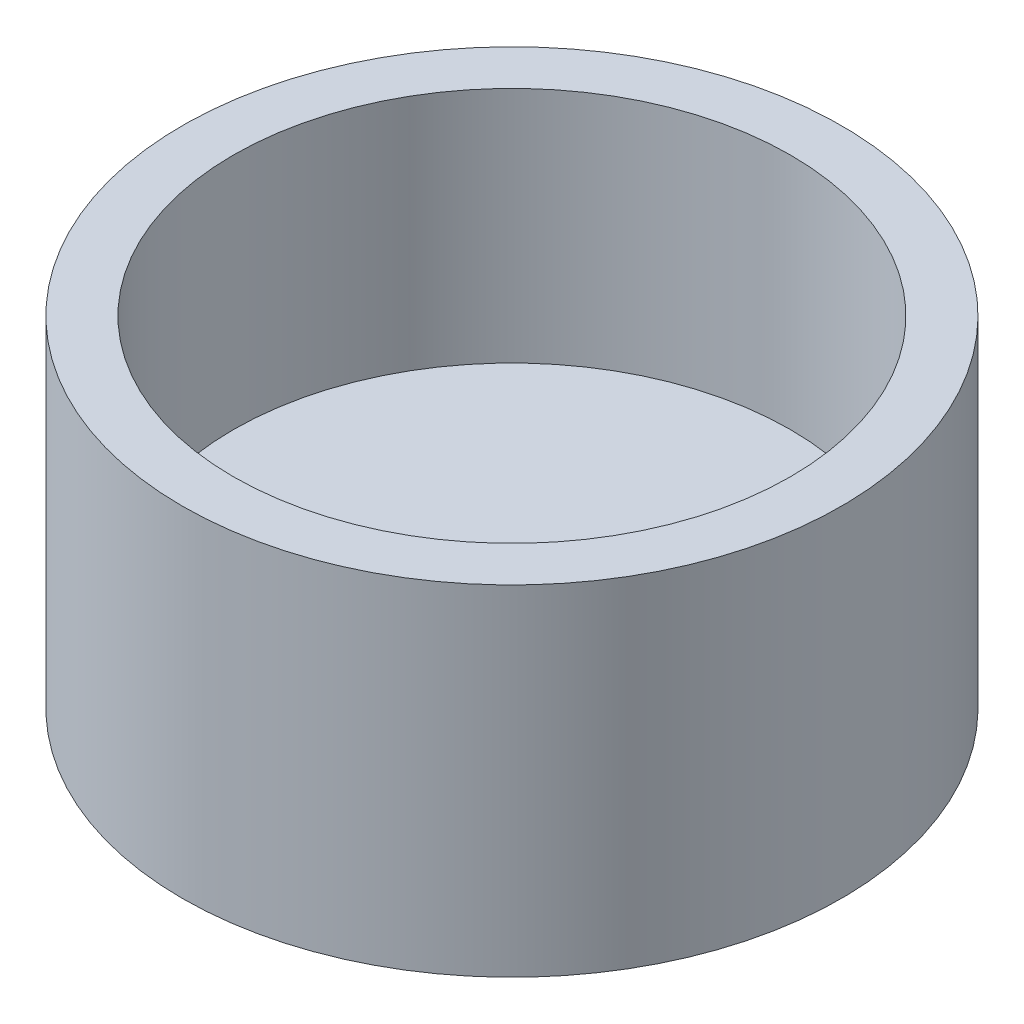
ISO-10303-21;
HEADER;
FILE_DESCRIPTION(('STEP AP214'),'2;1');
FILE_NAME('part.step','',(''),(''),'','','');
FILE_SCHEMA(('AUTOMOTIVE_DESIGN { 1 0 10303 214 1 1 1 1 }'));
ENDSEC;
DATA;
#1=APPLICATION_CONTEXT('core data for automotive mechanical design processes');
#2=APPLICATION_PROTOCOL_DEFINITION('international standard','automotive_design',2000,#1);
#3=PRODUCT_CONTEXT('',#1,'mechanical');
#4=PRODUCT('Part','Part','',(#3));
#5=PRODUCT_RELATED_PRODUCT_CATEGORY('part','',(#4));
#6=PRODUCT_DEFINITION_FORMATION('','',#4);
#7=PRODUCT_DEFINITION_CONTEXT('part definition',#1,'design');
#8=PRODUCT_DEFINITION('design','',#6,#7);
#9=PRODUCT_DEFINITION_SHAPE('','',#8);
#10=(LENGTH_UNIT() NAMED_UNIT(*) SI_UNIT(.MILLI.,.METRE.));
#11=(NAMED_UNIT(*) PLANE_ANGLE_UNIT() SI_UNIT($,.RADIAN.));
#12=(NAMED_UNIT(*) SI_UNIT($,.STERADIAN.) SOLID_ANGLE_UNIT());
#13=UNCERTAINTY_MEASURE_WITH_UNIT(LENGTH_MEASURE(1.E-05),#10,'distance_accuracy_value','');
#14=(GEOMETRIC_REPRESENTATION_CONTEXT(3) GLOBAL_UNCERTAINTY_ASSIGNED_CONTEXT((#13)) GLOBAL_UNIT_ASSIGNED_CONTEXT((#10,
#11,#12)) REPRESENTATION_CONTEXT('',''));
#15=CARTESIAN_POINT('',(0.,0.,0.));
#16=DIRECTION('',(0.,0.,1.));
#17=DIRECTION('',(1.,0.,0.));
#18=AXIS2_PLACEMENT_3D('',#15,#16,#17);
#19=CARTESIAN_POINT('',(0.,-1.,0.));
#20=DIRECTION('',(0.,1.,0.));
#21=DIRECTION('',(0.,0.,1.));
#22=AXIS2_PLACEMENT_3D('',#19,#20,#21);
#23=CYLINDRICAL_SURFACE('',#22,4.85);
#24=CARTESIAN_POINT('',(0.,-1.,0.));
#25=DIRECTION('',(0.,1.,0.));
#26=DIRECTION('',(0.,0.,1.));
#27=AXIS2_PLACEMENT_3D('',#24,#25,#26);
#28=CIRCLE('',#27,4.85);
#29=CARTESIAN_POINT('',(0.,-1.,4.85));
#30=VERTEX_POINT('',#29);
#31=EDGE_CURVE('E10',#30,#30,#28,.T.);
#32=ORIENTED_EDGE('',*,*,#31,.T.);
#33=EDGE_LOOP('',(#32));
#34=FACE_BOUND('',#33,.T.);
#35=CARTESIAN_POINT('',(0.,4.,0.));
#36=DIRECTION('',(0.,1.,0.));
#37=DIRECTION('',(0.,0.,1.));
#38=AXIS2_PLACEMENT_3D('',#35,#36,#37);
#39=CIRCLE('',#38,4.85);
#40=CARTESIAN_POINT('',(0.,4.,4.85));
#41=VERTEX_POINT('',#40);
#42=EDGE_CURVE('E44',#41,#41,#39,.T.);
#43=ORIENTED_EDGE('',*,*,#42,.F.);
#44=EDGE_LOOP('',(#43));
#45=FACE_BOUND('',#44,.T.);
#46=ADVANCED_FACE('F37',(#34,#45),#23,.T.);
#47=CARTESIAN_POINT('',(0.,-1.,0.));
#48=DIRECTION('',(0.,1.,0.));
#49=DIRECTION('',(0.,0.,1.));
#50=AXIS2_PLACEMENT_3D('',#47,#48,#49);
#51=PLANE('',#50);
#52=ORIENTED_EDGE('',*,*,#31,.F.);
#53=EDGE_LOOP('',(#52));
#54=FACE_BOUND('',#53,.T.);
#55=ADVANCED_FACE('F65',(#54),#51,.F.);
#56=CARTESIAN_POINT('',(0.,4.,0.));
#57=DIRECTION('',(0.,1.,0.));
#58=DIRECTION('',(0.,0.,1.));
#59=AXIS2_PLACEMENT_3D('',#56,#57,#58);
#60=PLANE('',#59);
#61=CARTESIAN_POINT('',(0.,4.,0.));
#62=DIRECTION('',(0.,1.,0.));
#63=DIRECTION('',(0.,0.,1.));
#64=AXIS2_PLACEMENT_3D('',#61,#62,#63);
#65=CIRCLE('',#64,4.1);
#66=CARTESIAN_POINT('',(0.,4.,4.1));
#67=VERTEX_POINT('',#66);
#68=EDGE_CURVE('E54',#67,#67,#65,.T.);
#69=ORIENTED_EDGE('',*,*,#68,.F.);
#70=EDGE_LOOP('',(#69));
#71=FACE_BOUND('',#70,.T.);
#72=ORIENTED_EDGE('',*,*,#42,.T.);
#73=EDGE_LOOP('',(#72));
#74=FACE_BOUND('',#73,.T.);
#75=ADVANCED_FACE('F63',(#71,#74),#60,.T.);
#76=CARTESIAN_POINT('',(0.,0.5,0.));
#77=DIRECTION('',(0.,1.,0.));
#78=DIRECTION('',(0.,0.,1.));
#79=AXIS2_PLACEMENT_3D('',#76,#77,#78);
#80=CYLINDRICAL_SURFACE('',#79,4.1);
#81=CARTESIAN_POINT('',(0.,0.5,0.));
#82=DIRECTION('',(0.,1.,0.));
#83=DIRECTION('',(0.,0.,1.));
#84=AXIS2_PLACEMENT_3D('',#81,#82,#83);
#85=CIRCLE('',#84,4.1);
#86=CARTESIAN_POINT('',(0.,0.5,4.1));
#87=VERTEX_POINT('',#86);
#88=EDGE_CURVE('E49',#87,#87,#85,.T.);
#89=ORIENTED_EDGE('',*,*,#88,.F.);
#90=EDGE_LOOP('',(#89));
#91=FACE_BOUND('',#90,.T.);
#92=ORIENTED_EDGE('',*,*,#68,.T.);
#93=EDGE_LOOP('',(#92));
#94=FACE_BOUND('',#93,.T.);
#95=ADVANCED_FACE('F61',(#91,#94),#80,.F.);
#96=CARTESIAN_POINT('',(0.,0.5,0.));
#97=DIRECTION('',(0.,1.,0.));
#98=DIRECTION('',(0.,0.,1.));
#99=AXIS2_PLACEMENT_3D('',#96,#97,#98);
#100=PLANE('',#99);
#101=ORIENTED_EDGE('',*,*,#88,.T.);
#102=EDGE_LOOP('',(#101));
#103=FACE_BOUND('',#102,.T.);
#104=ADVANCED_FACE('F71',(#103),#100,.T.);
#105=CLOSED_SHELL('',(#46,#55,#75,#95,#104));
#106=MANIFOLD_SOLID_BREP('B2',#105);
#107=ADVANCED_BREP_SHAPE_REPRESENTATION('',(#18,#106),#14);
#108=SHAPE_DEFINITION_REPRESENTATION(#9,#107);
ENDSEC;
END-ISO-10303-21;
